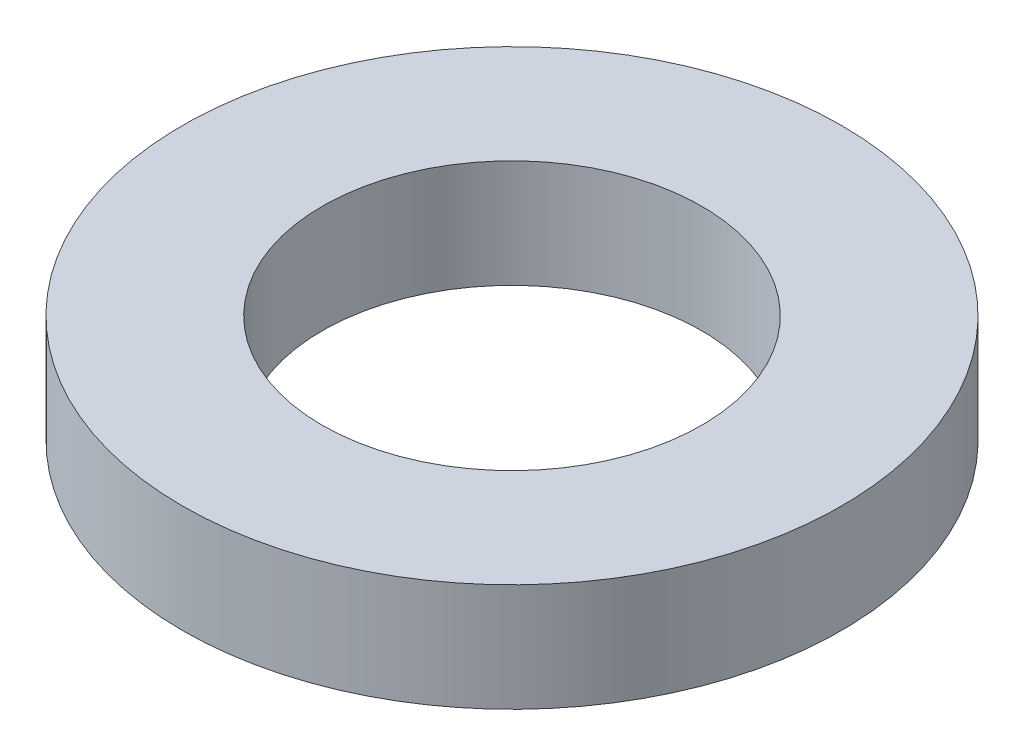
ISO-10303-21;
HEADER;
FILE_DESCRIPTION(('STEP AP214'),'2;1');
FILE_NAME('part.step','',(''),(''),'','','');
FILE_SCHEMA(('AUTOMOTIVE_DESIGN { 1 0 10303 214 1 1 1 1 }'));
ENDSEC;
DATA;
#1=APPLICATION_CONTEXT('core data for automotive mechanical design processes');
#2=APPLICATION_PROTOCOL_DEFINITION('international standard','automotive_design',2000,#1);
#3=PRODUCT_CONTEXT('',#1,'mechanical');
#4=PRODUCT('Part','Part','',(#3));
#5=PRODUCT_RELATED_PRODUCT_CATEGORY('part','',(#4));
#6=PRODUCT_DEFINITION_FORMATION('','',#4);
#7=PRODUCT_DEFINITION_CONTEXT('part definition',#1,'design');
#8=PRODUCT_DEFINITION('design','',#6,#7);
#9=PRODUCT_DEFINITION_SHAPE('','',#8);
#10=(LENGTH_UNIT() NAMED_UNIT(*) SI_UNIT(.MILLI.,.METRE.));
#11=(NAMED_UNIT(*) PLANE_ANGLE_UNIT() SI_UNIT($,.RADIAN.));
#12=(NAMED_UNIT(*) SI_UNIT($,.STERADIAN.) SOLID_ANGLE_UNIT());
#13=UNCERTAINTY_MEASURE_WITH_UNIT(LENGTH_MEASURE(1.E-05),#10,'distance_accuracy_value','');
#14=(GEOMETRIC_REPRESENTATION_CONTEXT(3) GLOBAL_UNCERTAINTY_ASSIGNED_CONTEXT((#13)) GLOBAL_UNIT_ASSIGNED_CONTEXT((#10,
#11,#12)) REPRESENTATION_CONTEXT('',''));
#15=CARTESIAN_POINT('',(0.,0.,0.));
#16=DIRECTION('',(0.,0.,1.));
#17=DIRECTION('',(1.,0.,0.));
#18=AXIS2_PLACEMENT_3D('',#15,#16,#17);
#19=CARTESIAN_POINT('',(0.,27.,0.));
#20=DIRECTION('',(0.,-1.,0.));
#21=DIRECTION('',(0.,0.,-1.));
#22=AXIS2_PLACEMENT_3D('',#19,#20,#21);
#23=CYLINDRICAL_SURFACE('',#22,82.5);
#24=CARTESIAN_POINT('',(0.,27.,0.));
#25=DIRECTION('',(0.,1.,0.));
#26=DIRECTION('',(0.,0.,1.));
#27=AXIS2_PLACEMENT_3D('',#24,#25,#26);
#28=CIRCLE('',#27,82.5);
#29=CARTESIAN_POINT('',(0.,27.,82.5));
#30=VERTEX_POINT('',#29);
#31=EDGE_CURVE('E10',#30,#30,#28,.T.);
#32=ORIENTED_EDGE('',*,*,#31,.F.);
#33=EDGE_LOOP('',(#32));
#34=FACE_BOUND('',#33,.T.);
#35=CARTESIAN_POINT('',(0.,0.,0.));
#36=DIRECTION('',(0.,1.,0.));
#37=DIRECTION('',(0.,0.,1.));
#38=AXIS2_PLACEMENT_3D('',#35,#36,#37);
#39=CIRCLE('',#38,82.5);
#40=CARTESIAN_POINT('',(0.,0.,82.5));
#41=VERTEX_POINT('',#40);
#42=EDGE_CURVE('E37',#41,#41,#39,.T.);
#43=ORIENTED_EDGE('',*,*,#42,.T.);
#44=EDGE_LOOP('',(#43));
#45=FACE_BOUND('',#44,.T.);
#46=ADVANCED_FACE('F40',(#34,#45),#23,.T.);
#47=CARTESIAN_POINT('',(0.,27.,0.));
#48=DIRECTION('',(0.,1.,0.));
#49=DIRECTION('',(0.,0.,1.));
#50=AXIS2_PLACEMENT_3D('',#47,#48,#49);
#51=PLANE('',#50);
#52=CARTESIAN_POINT('',(0.,27.,0.));
#53=DIRECTION('',(0.,1.,0.));
#54=DIRECTION('',(0.,0.,1.));
#55=AXIS2_PLACEMENT_3D('',#52,#53,#54);
#56=CIRCLE('',#55,47.5);
#57=CARTESIAN_POINT('',(0.,27.,47.5));
#58=VERTEX_POINT('',#57);
#59=EDGE_CURVE('E50',#58,#58,#56,.T.);
#60=ORIENTED_EDGE('',*,*,#59,.F.);
#61=EDGE_LOOP('',(#60));
#62=FACE_BOUND('',#61,.T.);
#63=ORIENTED_EDGE('',*,*,#31,.T.);
#64=EDGE_LOOP('',(#63));
#65=FACE_BOUND('',#64,.T.);
#66=ADVANCED_FACE('F59',(#62,#65),#51,.T.);
#67=CARTESIAN_POINT('',(0.,0.,0.));
#68=DIRECTION('',(0.,1.,0.));
#69=DIRECTION('',(0.,0.,1.));
#70=AXIS2_PLACEMENT_3D('',#67,#68,#69);
#71=PLANE('',#70);
#72=CARTESIAN_POINT('',(0.,0.,0.));
#73=DIRECTION('',(0.,1.,0.));
#74=DIRECTION('',(0.,0.,1.));
#75=AXIS2_PLACEMENT_3D('',#72,#73,#74);
#76=CIRCLE('',#75,47.5);
#77=CARTESIAN_POINT('',(0.,0.,47.5));
#78=VERTEX_POINT('',#77);
#79=EDGE_CURVE('E47',#78,#78,#76,.T.);
#80=ORIENTED_EDGE('',*,*,#79,.T.);
#81=EDGE_LOOP('',(#80));
#82=FACE_BOUND('',#81,.T.);
#83=ORIENTED_EDGE('',*,*,#42,.F.);
#84=EDGE_LOOP('',(#83));
#85=FACE_BOUND('',#84,.T.);
#86=ADVANCED_FACE('F58',(#82,#85),#71,.F.);
#87=CARTESIAN_POINT('',(0.,27.,0.));
#88=DIRECTION('',(0.,-1.,0.));
#89=DIRECTION('',(0.,0.,-1.));
#90=AXIS2_PLACEMENT_3D('',#87,#88,#89);
#91=CYLINDRICAL_SURFACE('',#90,47.5);
#92=ORIENTED_EDGE('',*,*,#59,.T.);
#93=EDGE_LOOP('',(#92));
#94=FACE_BOUND('',#93,.T.);
#95=ORIENTED_EDGE('',*,*,#79,.F.);
#96=EDGE_LOOP('',(#95));
#97=FACE_BOUND('',#96,.T.);
#98=ADVANCED_FACE('F54',(#94,#97),#91,.F.);
#99=CLOSED_SHELL('',(#46,#66,#86,#98));
#100=MANIFOLD_SOLID_BREP('B2',#99);
#101=ADVANCED_BREP_SHAPE_REPRESENTATION('',(#18,#100),#14);
#102=SHAPE_DEFINITION_REPRESENTATION(#9,#101);
ENDSEC;
END-ISO-10303-21;
